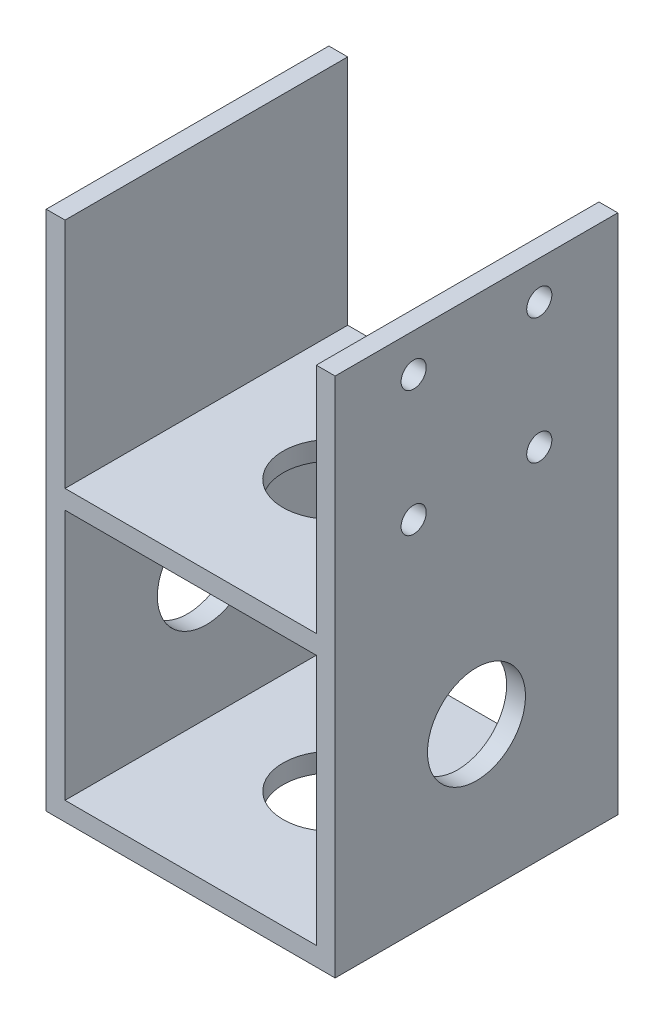
ISO-10303-21;
HEADER;
FILE_DESCRIPTION(('STEP AP214'),'2;1');
FILE_NAME('part.step','',(''),(''),'','','');
FILE_SCHEMA(('AUTOMOTIVE_DESIGN { 1 0 10303 214 1 1 1 1 }'));
ENDSEC;
DATA;
#1=APPLICATION_CONTEXT('core data for automotive mechanical design processes');
#2=APPLICATION_PROTOCOL_DEFINITION('international standard','automotive_design',2000,#1);
#3=PRODUCT_CONTEXT('',#1,'mechanical');
#4=PRODUCT('Part','Part','',(#3));
#5=PRODUCT_RELATED_PRODUCT_CATEGORY('part','',(#4));
#6=PRODUCT_DEFINITION_FORMATION('','',#4);
#7=PRODUCT_DEFINITION_CONTEXT('part definition',#1,'design');
#8=PRODUCT_DEFINITION('design','',#6,#7);
#9=PRODUCT_DEFINITION_SHAPE('','',#8);
#10=(LENGTH_UNIT() NAMED_UNIT(*) SI_UNIT(.MILLI.,.METRE.));
#11=(NAMED_UNIT(*) PLANE_ANGLE_UNIT() SI_UNIT($,.RADIAN.));
#12=(NAMED_UNIT(*) SI_UNIT($,.STERADIAN.) SOLID_ANGLE_UNIT());
#13=UNCERTAINTY_MEASURE_WITH_UNIT(LENGTH_MEASURE(1.E-05),#10,'distance_accuracy_value','');
#14=(GEOMETRIC_REPRESENTATION_CONTEXT(3) GLOBAL_UNCERTAINTY_ASSIGNED_CONTEXT((#13)) GLOBAL_UNIT_ASSIGNED_CONTEXT((#10,
#11,#12)) REPRESENTATION_CONTEXT('',''));
#15=CARTESIAN_POINT('',(0.,0.,0.));
#16=DIRECTION('',(0.,0.,1.));
#17=DIRECTION('',(1.,0.,0.));
#18=AXIS2_PLACEMENT_3D('',#15,#16,#17);
#19=CARTESIAN_POINT('',(20.,38.,-22.5));
#20=DIRECTION('',(1.,0.,0.));
#21=DIRECTION('',(0.,0.,-1.));
#22=AXIS2_PLACEMENT_3D('',#19,#20,#21);
#23=PLANE('',#22);
#24=CARTESIAN_POINT('',(20.,76.9556629991102,10.));
#25=DIRECTION('',(1.,0.,0.));
#26=DIRECTION('',(0.,0.,-1.));
#27=AXIS2_PLACEMENT_3D('',#24,#25,#26);
#28=CIRCLE('',#27,2.);
#29=CARTESIAN_POINT('',(20.,76.9556629991102,8.));
#30=VERTEX_POINT('',#29);
#31=EDGE_CURVE('E171',#30,#30,#28,.T.);
#32=ORIENTED_EDGE('',*,*,#31,.T.);
#33=EDGE_LOOP('',(#32));
#34=FACE_BOUND('',#33,.T.);
#35=CARTESIAN_POINT('',(20.,76.9556629991102,-10.));
#36=DIRECTION('',(1.,0.,0.));
#37=DIRECTION('',(0.,0.,-1.));
#38=AXIS2_PLACEMENT_3D('',#35,#36,#37);
#39=CIRCLE('',#38,2.);
#40=CARTESIAN_POINT('',(20.,76.9556629991102,-12.));
#41=VERTEX_POINT('',#40);
#42=EDGE_CURVE('E249',#41,#41,#39,.T.);
#43=ORIENTED_EDGE('',*,*,#42,.T.);
#44=EDGE_LOOP('',(#43));
#45=FACE_BOUND('',#44,.T.);
#46=CARTESIAN_POINT('',(20.,56.9556629991102,-10.));
#47=DIRECTION('',(1.,0.,0.));
#48=DIRECTION('',(0.,0.,-1.));
#49=AXIS2_PLACEMENT_3D('',#46,#47,#48);
#50=CIRCLE('',#49,2.);
#51=CARTESIAN_POINT('',(20.,56.9556629991102,-12.));
#52=VERTEX_POINT('',#51);
#53=EDGE_CURVE('E252',#52,#52,#50,.T.);
#54=ORIENTED_EDGE('',*,*,#53,.T.);
#55=EDGE_LOOP('',(#54));
#56=FACE_BOUND('',#55,.T.);
#57=CARTESIAN_POINT('',(20.,56.9556629991102,10.));
#58=DIRECTION('',(1.,0.,0.));
#59=DIRECTION('',(0.,0.,-1.));
#60=AXIS2_PLACEMENT_3D('',#57,#58,#59);
#61=CIRCLE('',#60,2.);
#62=CARTESIAN_POINT('',(20.,56.9556629991102,8.));
#63=VERTEX_POINT('',#62);
#64=EDGE_CURVE('E176',#63,#63,#61,.T.);
#65=ORIENTED_EDGE('',*,*,#64,.T.);
#66=EDGE_LOOP('',(#65));
#67=FACE_BOUND('',#66,.T.);
#68=DIRECTION('',(0.,0.,-1.));
#69=VECTOR('',#68,1.);
#70=CARTESIAN_POINT('',(20.,46.,-22.5));
#71=LINE('',#70,#69);
#72=CARTESIAN_POINT('',(20.,46.,22.5));
#73=VERTEX_POINT('',#72);
#74=CARTESIAN_POINT('',(20.,46.,-22.5));
#75=VERTEX_POINT('',#74);
#76=EDGE_CURVE('E156',#73,#75,#71,.T.);
#77=ORIENTED_EDGE('',*,*,#76,.F.);
#78=DIRECTION('',(0.,-1.,0.));
#79=VECTOR('',#78,1.);
#80=CARTESIAN_POINT('',(20.,38.,22.5));
#81=LINE('',#80,#79);
#82=CARTESIAN_POINT('',(20.,83.,22.5));
#83=VERTEX_POINT('',#82);
#84=EDGE_CURVE('E147',#83,#73,#81,.T.);
#85=ORIENTED_EDGE('',*,*,#84,.F.);
#86=DIRECTION('',(0.,0.,1.));
#87=VECTOR('',#86,1.);
#88=CARTESIAN_POINT('',(20.,83.,-22.5));
#89=LINE('',#88,#87);
#90=CARTESIAN_POINT('',(20.,83.,-22.5));
#91=VERTEX_POINT('',#90);
#92=EDGE_CURVE('E172',#91,#83,#89,.T.);
#93=ORIENTED_EDGE('',*,*,#92,.F.);
#94=DIRECTION('',(0.,-1.,0.));
#95=VECTOR('',#94,1.);
#96=CARTESIAN_POINT('',(20.,38.,-22.5));
#97=LINE('',#96,#95);
#98=EDGE_CURVE('E217',#91,#75,#97,.T.);
#99=ORIENTED_EDGE('',*,*,#98,.T.);
#100=EDGE_LOOP('',(#77,#85,#93,#99));
#101=FACE_BOUND('',#100,.T.);
#102=ADVANCED_FACE('F34',(#34,#45,#56,#67,#101),#23,.F.);
#103=CARTESIAN_POINT('',(-20.,38.,-22.5));
#104=DIRECTION('',(-1.,0.,0.));
#105=DIRECTION('',(0.,0.,1.));
#106=AXIS2_PLACEMENT_3D('',#103,#104,#105);
#107=PLANE('',#106);
#108=DIRECTION('',(0.,0.,1.));
#109=VECTOR('',#108,1.);
#110=CARTESIAN_POINT('',(-20.,46.,-22.5));
#111=LINE('',#110,#109);
#112=CARTESIAN_POINT('',(-20.,46.,-22.5));
#113=VERTEX_POINT('',#112);
#114=CARTESIAN_POINT('',(-20.,46.,22.5));
#115=VERTEX_POINT('',#114);
#116=EDGE_CURVE('E43',#113,#115,#111,.T.);
#117=ORIENTED_EDGE('',*,*,#116,.F.);
#118=DIRECTION('',(0.,-1.,0.));
#119=VECTOR('',#118,1.);
#120=CARTESIAN_POINT('',(-20.,38.,-22.5));
#121=LINE('',#120,#119);
#122=CARTESIAN_POINT('',(-20.,83.,-22.5));
#123=VERTEX_POINT('',#122);
#124=EDGE_CURVE('E212',#123,#113,#121,.T.);
#125=ORIENTED_EDGE('',*,*,#124,.F.);
#126=DIRECTION('',(0.,0.,-1.));
#127=VECTOR('',#126,1.);
#128=CARTESIAN_POINT('',(-20.,83.,-22.5));
#129=LINE('',#128,#127);
#130=CARTESIAN_POINT('',(-20.,83.,22.5));
#131=VERTEX_POINT('',#130);
#132=EDGE_CURVE('E125',#131,#123,#129,.T.);
#133=ORIENTED_EDGE('',*,*,#132,.F.);
#134=DIRECTION('',(0.,-1.,0.));
#135=VECTOR('',#134,1.);
#136=CARTESIAN_POINT('',(-20.,38.,22.5));
#137=LINE('',#136,#135);
#138=EDGE_CURVE('E120',#131,#115,#137,.T.);
#139=ORIENTED_EDGE('',*,*,#138,.T.);
#140=EDGE_LOOP('',(#117,#125,#133,#139));
#141=FACE_BOUND('',#140,.T.);
#142=ADVANCED_FACE('F122',(#141),#107,.F.);
#143=CARTESIAN_POINT('',(0.,3.,0.));
#144=DIRECTION('',(0.,1.,0.));
#145=DIRECTION('',(0.,0.,1.));
#146=AXIS2_PLACEMENT_3D('',#143,#144,#145);
#147=PLANE('',#146);
#148=CARTESIAN_POINT('',(0.,3.,0.));
#149=DIRECTION('',(0.,1.,0.));
#150=DIRECTION('',(0.,0.,1.));
#151=AXIS2_PLACEMENT_3D('',#148,#149,#150);
#152=CIRCLE('',#151,7.8);
#153=CARTESIAN_POINT('',(0.,3.,7.8));
#154=VERTEX_POINT('',#153);
#155=EDGE_CURVE('E204',#154,#154,#152,.T.);
#156=ORIENTED_EDGE('',*,*,#155,.F.);
#157=EDGE_LOOP('',(#156));
#158=FACE_BOUND('',#157,.T.);
#159=DIRECTION('',(-1.,0.,0.));
#160=VECTOR('',#159,1.);
#161=CARTESIAN_POINT('',(23.,3.,-22.5));
#162=LINE('',#161,#160);
#163=CARTESIAN_POINT('',(20.,3.,-22.5));
#164=VERTEX_POINT('',#163);
#165=CARTESIAN_POINT('',(-20.,3.,-22.5));
#166=VERTEX_POINT('',#165);
#167=EDGE_CURVE('E223',#164,#166,#162,.T.);
#168=ORIENTED_EDGE('',*,*,#167,.T.);
#169=DIRECTION('',(0.,0.,-1.));
#170=VECTOR('',#169,1.);
#171=CARTESIAN_POINT('',(-20.,3.,-22.5));
#172=LINE('',#171,#170);
#173=CARTESIAN_POINT('',(-20.,3.,22.5));
#174=VERTEX_POINT('',#173);
#175=EDGE_CURVE('E208',#174,#166,#172,.T.);
#176=ORIENTED_EDGE('',*,*,#175,.F.);
#177=DIRECTION('',(1.,0.,0.));
#178=VECTOR('',#177,1.);
#179=CARTESIAN_POINT('',(23.,3.,22.5));
#180=LINE('',#179,#178);
#181=CARTESIAN_POINT('',(20.,3.,22.5));
#182=VERTEX_POINT('',#181);
#183=EDGE_CURVE('E220',#174,#182,#180,.T.);
#184=ORIENTED_EDGE('',*,*,#183,.T.);
#185=DIRECTION('',(0.,0.,1.));
#186=VECTOR('',#185,1.);
#187=CARTESIAN_POINT('',(20.,3.,-22.5));
#188=LINE('',#187,#186);
#189=EDGE_CURVE('E130',#164,#182,#188,.T.);
#190=ORIENTED_EDGE('',*,*,#189,.F.);
#191=EDGE_LOOP('',(#168,#176,#184,#190));
#192=FACE_BOUND('',#191,.T.);
#193=ADVANCED_FACE('F283',(#158,#192),#147,.T.);
#194=CARTESIAN_POINT('',(-23.,3.,22.5));
#195=DIRECTION('',(1.,0.,0.));
#196=DIRECTION('',(0.,0.,-1.));
#197=AXIS2_PLACEMENT_3D('',#194,#195,#196);
#198=PLANE('',#197);
#199=CARTESIAN_POINT('',(-23.,23.75,0.));
#200=DIRECTION('',(-1.,0.,0.));
#201=DIRECTION('',(0.,0.,1.));
#202=AXIS2_PLACEMENT_3D('',#199,#200,#201);
#203=CIRCLE('',#202,7.8);
#204=CARTESIAN_POINT('',(-23.,23.75,7.80000000000001));
#205=VERTEX_POINT('',#204);
#206=EDGE_CURVE('E194',#205,#205,#203,.T.);
#207=ORIENTED_EDGE('',*,*,#206,.F.);
#208=EDGE_LOOP('',(#207));
#209=FACE_BOUND('',#208,.T.);
#210=DIRECTION('',(0.,0.,1.));
#211=VECTOR('',#210,1.);
#212=CARTESIAN_POINT('',(-23.,0.,22.5));
#213=LINE('',#212,#211);
#214=CARTESIAN_POINT('',(-23.,0.,-22.5));
#215=VERTEX_POINT('',#214);
#216=CARTESIAN_POINT('',(-23.,0.,22.5));
#217=VERTEX_POINT('',#216);
#218=EDGE_CURVE('E219',#215,#217,#213,.T.);
#219=ORIENTED_EDGE('',*,*,#218,.T.);
#220=DIRECTION('',(0.,-1.,0.));
#221=VECTOR('',#220,1.);
#222=CARTESIAN_POINT('',(-23.,3.,22.5));
#223=LINE('',#222,#221);
#224=CARTESIAN_POINT('',(-23.,83.,22.5));
#225=VERTEX_POINT('',#224);
#226=EDGE_CURVE('E141',#225,#217,#223,.T.);
#227=ORIENTED_EDGE('',*,*,#226,.F.);
#228=DIRECTION('',(0.,0.,1.));
#229=VECTOR('',#228,1.);
#230=CARTESIAN_POINT('',(-23.,83.,-22.5));
#231=LINE('',#230,#229);
#232=CARTESIAN_POINT('',(-23.,83.,-22.5));
#233=VERTEX_POINT('',#232);
#234=EDGE_CURVE('E185',#233,#225,#231,.T.);
#235=ORIENTED_EDGE('',*,*,#234,.F.);
#236=DIRECTION('',(0.,-1.,0.));
#237=VECTOR('',#236,1.);
#238=CARTESIAN_POINT('',(-23.,3.,-22.5));
#239=LINE('',#238,#237);
#240=EDGE_CURVE('E227',#233,#215,#239,.T.);
#241=ORIENTED_EDGE('',*,*,#240,.T.);
#242=EDGE_LOOP('',(#219,#227,#235,#241));
#243=FACE_BOUND('',#242,.T.);
#244=ADVANCED_FACE('F36',(#209,#243),#198,.F.);
#245=CARTESIAN_POINT('',(23.,3.,22.5));
#246=DIRECTION('',(0.,0.,-1.));
#247=DIRECTION('',(-1.,0.,0.));
#248=AXIS2_PLACEMENT_3D('',#245,#246,#247);
#249=PLANE('',#248);
#250=DIRECTION('',(1.,0.,0.));
#251=VECTOR('',#250,1.);
#252=CARTESIAN_POINT('',(23.,43.,22.5));
#253=LINE('',#252,#251);
#254=CARTESIAN_POINT('',(-20.,43.,22.5));
#255=VERTEX_POINT('',#254);
#256=CARTESIAN_POINT('',(20.,43.,22.5));
#257=VERTEX_POINT('',#256);
#258=EDGE_CURVE('E151',#255,#257,#253,.T.);
#259=ORIENTED_EDGE('',*,*,#258,.T.);
#260=EDGE_CURVE('E55',#257,#182,#81,.T.);
#261=ORIENTED_EDGE('',*,*,#260,.T.);
#262=ORIENTED_EDGE('',*,*,#183,.F.);
#263=EDGE_CURVE('E131',#255,#174,#137,.T.);
#264=ORIENTED_EDGE('',*,*,#263,.F.);
#265=EDGE_LOOP('',(#259,#261,#262,#264));
#266=FACE_BOUND('',#265,.T.);
#267=DIRECTION('',(1.,0.,0.));
#268=VECTOR('',#267,1.);
#269=CARTESIAN_POINT('',(23.,0.,22.5));
#270=LINE('',#269,#268);
#271=CARTESIAN_POINT('',(23.,0.,22.5));
#272=VERTEX_POINT('',#271);
#273=EDGE_CURVE('E230',#217,#272,#270,.T.);
#274=ORIENTED_EDGE('',*,*,#273,.T.);
#275=DIRECTION('',(0.,-1.,0.));
#276=VECTOR('',#275,1.);
#277=CARTESIAN_POINT('',(23.,3.,22.5));
#278=LINE('',#277,#276);
#279=CARTESIAN_POINT('',(23.,83.,22.5));
#280=VERTEX_POINT('',#279);
#281=EDGE_CURVE('E240',#280,#272,#278,.T.);
#282=ORIENTED_EDGE('',*,*,#281,.F.);
#283=DIRECTION('',(1.,0.,0.));
#284=VECTOR('',#283,1.);
#285=CARTESIAN_POINT('',(20.,83.,22.5));
#286=LINE('',#285,#284);
#287=EDGE_CURVE('E175',#83,#280,#286,.T.);
#288=ORIENTED_EDGE('',*,*,#287,.F.);
#289=ORIENTED_EDGE('',*,*,#84,.T.);
#290=DIRECTION('',(1.,0.,0.));
#291=VECTOR('',#290,1.);
#292=CARTESIAN_POINT('',(23.,46.,22.5));
#293=LINE('',#292,#291);
#294=EDGE_CURVE('E138',#115,#73,#293,.T.);
#295=ORIENTED_EDGE('',*,*,#294,.F.);
#296=ORIENTED_EDGE('',*,*,#138,.F.);
#297=DIRECTION('',(1.,0.,0.));
#298=VECTOR('',#297,1.);
#299=CARTESIAN_POINT('',(-23.,83.,22.5));
#300=LINE('',#299,#298);
#301=EDGE_CURVE('E188',#225,#131,#300,.T.);
#302=ORIENTED_EDGE('',*,*,#301,.F.);
#303=ORIENTED_EDGE('',*,*,#226,.T.);
#304=EDGE_LOOP('',(#274,#282,#288,#289,#295,#296,#302,#303));
#305=FACE_BOUND('',#304,.T.);
#306=ADVANCED_FACE('F145',(#266,#305),#249,.F.);
#307=CARTESIAN_POINT('',(23.,3.,22.5));
#308=DIRECTION('',(-1.,0.,0.));
#309=DIRECTION('',(0.,0.,1.));
#310=AXIS2_PLACEMENT_3D('',#307,#308,#309);
#311=PLANE('',#310);
#312=CARTESIAN_POINT('',(23.,23.75,0.));
#313=DIRECTION('',(-1.,0.,0.));
#314=DIRECTION('',(0.,0.,1.));
#315=AXIS2_PLACEMENT_3D('',#312,#313,#314);
#316=CIRCLE('',#315,7.8);
#317=CARTESIAN_POINT('',(23.,23.75,7.80000000000001));
#318=VERTEX_POINT('',#317);
#319=EDGE_CURVE('E195',#318,#318,#316,.T.);
#320=ORIENTED_EDGE('',*,*,#319,.T.);
#321=EDGE_LOOP('',(#320));
#322=FACE_BOUND('',#321,.T.);
#323=DIRECTION('',(0.,0.,-1.));
#324=VECTOR('',#323,1.);
#325=CARTESIAN_POINT('',(23.,0.,22.5));
#326=LINE('',#325,#324);
#327=CARTESIAN_POINT('',(23.,0.,-22.5));
#328=VERTEX_POINT('',#327);
#329=EDGE_CURVE('E232',#272,#328,#326,.T.);
#330=ORIENTED_EDGE('',*,*,#329,.T.);
#331=DIRECTION('',(0.,-1.,0.));
#332=VECTOR('',#331,1.);
#333=CARTESIAN_POINT('',(23.,3.,-22.5));
#334=LINE('',#333,#332);
#335=CARTESIAN_POINT('',(23.,83.,-22.5));
#336=VERTEX_POINT('',#335);
#337=EDGE_CURVE('E238',#336,#328,#334,.T.);
#338=ORIENTED_EDGE('',*,*,#337,.F.);
#339=DIRECTION('',(0.,0.,-1.));
#340=VECTOR('',#339,1.);
#341=CARTESIAN_POINT('',(23.,83.,-22.5));
#342=LINE('',#341,#340);
#343=EDGE_CURVE('E179',#280,#336,#342,.T.);
#344=ORIENTED_EDGE('',*,*,#343,.F.);
#345=ORIENTED_EDGE('',*,*,#281,.T.);
#346=EDGE_LOOP('',(#330,#338,#344,#345));
#347=FACE_BOUND('',#346,.T.);
#348=CARTESIAN_POINT('',(23.,76.9556629991102,10.));
#349=DIRECTION('',(1.,0.,0.));
#350=DIRECTION('',(0.,0.,-1.));
#351=AXIS2_PLACEMENT_3D('',#348,#349,#350);
#352=CIRCLE('',#351,2.);
#353=CARTESIAN_POINT('',(23.,76.9556629991102,8.));
#354=VERTEX_POINT('',#353);
#355=EDGE_CURVE('E163',#354,#354,#352,.T.);
#356=ORIENTED_EDGE('',*,*,#355,.F.);
#357=EDGE_LOOP('',(#356));
#358=FACE_BOUND('',#357,.T.);
#359=CARTESIAN_POINT('',(23.,76.9556629991102,-10.));
#360=DIRECTION('',(1.,0.,0.));
#361=DIRECTION('',(0.,0.,1.));
#362=AXIS2_PLACEMENT_3D('',#359,#360,#361);
#363=CIRCLE('',#362,2.);
#364=CARTESIAN_POINT('',(23.,76.9556629991102,-8.));
#365=VERTEX_POINT('',#364);
#366=EDGE_CURVE('E160',#365,#365,#363,.T.);
#367=ORIENTED_EDGE('',*,*,#366,.F.);
#368=EDGE_LOOP('',(#367));
#369=FACE_BOUND('',#368,.T.);
#370=CARTESIAN_POINT('',(23.,56.9556629991102,-10.));
#371=DIRECTION('',(1.,0.,0.));
#372=DIRECTION('',(0.,0.,-1.));
#373=AXIS2_PLACEMENT_3D('',#370,#371,#372);
#374=CIRCLE('',#373,2.);
#375=CARTESIAN_POINT('',(23.,56.9556629991102,-12.));
#376=VERTEX_POINT('',#375);
#377=EDGE_CURVE('E164',#376,#376,#374,.T.);
#378=ORIENTED_EDGE('',*,*,#377,.F.);
#379=EDGE_LOOP('',(#378));
#380=FACE_BOUND('',#379,.T.);
#381=CARTESIAN_POINT('',(23.,56.9556629991102,10.));
#382=DIRECTION('',(1.,0.,0.));
#383=DIRECTION('',(0.,0.,1.));
#384=AXIS2_PLACEMENT_3D('',#381,#382,#383);
#385=CIRCLE('',#384,2.);
#386=CARTESIAN_POINT('',(23.,56.9556629991102,12.));
#387=VERTEX_POINT('',#386);
#388=EDGE_CURVE('E159',#387,#387,#385,.T.);
#389=ORIENTED_EDGE('',*,*,#388,.F.);
#390=EDGE_LOOP('',(#389));
#391=FACE_BOUND('',#390,.T.);
#392=ADVANCED_FACE('F338',(#322,#347,#358,#369,#380,#391),#311,.F.);
#393=CARTESIAN_POINT('',(23.,3.,-22.5));
#394=DIRECTION('',(0.,0.,1.));
#395=DIRECTION('',(1.,0.,0.));
#396=AXIS2_PLACEMENT_3D('',#393,#394,#395);
#397=PLANE('',#396);
#398=DIRECTION('',(-1.,0.,0.));
#399=VECTOR('',#398,1.);
#400=CARTESIAN_POINT('',(23.,43.,-22.5));
#401=LINE('',#400,#399);
#402=CARTESIAN_POINT('',(20.,43.,-22.5));
#403=VERTEX_POINT('',#402);
#404=CARTESIAN_POINT('',(-20.,43.,-22.5));
#405=VERTEX_POINT('',#404);
#406=EDGE_CURVE('E148',#403,#405,#401,.T.);
#407=ORIENTED_EDGE('',*,*,#406,.T.);
#408=EDGE_CURVE('E211',#405,#166,#121,.T.);
#409=ORIENTED_EDGE('',*,*,#408,.T.);
#410=ORIENTED_EDGE('',*,*,#167,.F.);
#411=EDGE_CURVE('E216',#403,#164,#97,.T.);
#412=ORIENTED_EDGE('',*,*,#411,.F.);
#413=EDGE_LOOP('',(#407,#409,#410,#412));
#414=FACE_BOUND('',#413,.T.);
#415=DIRECTION('',(-1.,0.,0.));
#416=VECTOR('',#415,1.);
#417=CARTESIAN_POINT('',(23.,0.,-22.5));
#418=LINE('',#417,#416);
#419=EDGE_CURVE('E224',#328,#215,#418,.T.);
#420=ORIENTED_EDGE('',*,*,#419,.T.);
#421=ORIENTED_EDGE('',*,*,#240,.F.);
#422=DIRECTION('',(-1.,0.,0.));
#423=VECTOR('',#422,1.);
#424=CARTESIAN_POINT('',(-23.,83.,-22.5));
#425=LINE('',#424,#423);
#426=EDGE_CURVE('E191',#123,#233,#425,.T.);
#427=ORIENTED_EDGE('',*,*,#426,.F.);
#428=ORIENTED_EDGE('',*,*,#124,.T.);
#429=DIRECTION('',(-1.,0.,0.));
#430=VECTOR('',#429,1.);
#431=CARTESIAN_POINT('',(23.,46.,-22.5));
#432=LINE('',#431,#430);
#433=EDGE_CURVE('E140',#75,#113,#432,.T.);
#434=ORIENTED_EDGE('',*,*,#433,.F.);
#435=ORIENTED_EDGE('',*,*,#98,.F.);
#436=DIRECTION('',(-1.,0.,0.));
#437=VECTOR('',#436,1.);
#438=CARTESIAN_POINT('',(20.,83.,-22.5));
#439=LINE('',#438,#437);
#440=EDGE_CURVE('E182',#336,#91,#439,.T.);
#441=ORIENTED_EDGE('',*,*,#440,.F.);
#442=ORIENTED_EDGE('',*,*,#337,.T.);
#443=EDGE_LOOP('',(#420,#421,#427,#428,#434,#435,#441,#442));
#444=FACE_BOUND('',#443,.T.);
#445=ADVANCED_FACE('F297',(#414,#444),#397,.F.);
#446=CARTESIAN_POINT('',(0.,0.,0.));
#447=DIRECTION('',(0.,1.,0.));
#448=DIRECTION('',(0.,0.,1.));
#449=AXIS2_PLACEMENT_3D('',#446,#447,#448);
#450=PLANE('',#449);
#451=CARTESIAN_POINT('',(0.,0.,0.));
#452=DIRECTION('',(0.,1.,0.));
#453=DIRECTION('',(0.,0.,1.));
#454=AXIS2_PLACEMENT_3D('',#451,#452,#453);
#455=CIRCLE('',#454,7.8);
#456=CARTESIAN_POINT('',(0.,0.,7.8));
#457=VERTEX_POINT('',#456);
#458=EDGE_CURVE('E207',#457,#457,#455,.T.);
#459=ORIENTED_EDGE('',*,*,#458,.T.);
#460=EDGE_LOOP('',(#459));
#461=FACE_BOUND('',#460,.T.);
#462=ORIENTED_EDGE('',*,*,#218,.F.);
#463=ORIENTED_EDGE('',*,*,#419,.F.);
#464=ORIENTED_EDGE('',*,*,#329,.F.);
#465=ORIENTED_EDGE('',*,*,#273,.F.);
#466=EDGE_LOOP('',(#462,#463,#464,#465));
#467=FACE_BOUND('',#466,.T.);
#468=ADVANCED_FACE('F289',(#461,#467),#450,.F.);
#469=CARTESIAN_POINT('',(20.,23.75,0.));
#470=DIRECTION('',(1.,0.,0.));
#471=DIRECTION('',(0.,0.,-1.));
#472=AXIS2_PLACEMENT_3D('',#469,#470,#471);
#473=CIRCLE('',#472,7.8);
#474=CARTESIAN_POINT('',(20.,23.75,-7.8));
#475=VERTEX_POINT('',#474);
#476=EDGE_CURVE('E201',#475,#475,#473,.T.);
#477=ORIENTED_EDGE('',*,*,#476,.T.);
#478=EDGE_LOOP('',(#477));
#479=FACE_BOUND('',#478,.T.);
#480=ORIENTED_EDGE('',*,*,#260,.F.);
#481=DIRECTION('',(0.,0.,-1.));
#482=VECTOR('',#481,1.);
#483=CARTESIAN_POINT('',(20.,43.,-22.5));
#484=LINE('',#483,#482);
#485=EDGE_CURVE('E50',#257,#403,#484,.T.);
#486=ORIENTED_EDGE('',*,*,#485,.T.);
#487=ORIENTED_EDGE('',*,*,#411,.T.);
#488=ORIENTED_EDGE('',*,*,#189,.T.);
#489=EDGE_LOOP('',(#480,#486,#487,#488));
#490=FACE_BOUND('',#489,.T.);
#491=ADVANCED_FACE('F279',(#479,#490),#23,.F.);
#492=CARTESIAN_POINT('',(-20.,23.75,0.));
#493=DIRECTION('',(-1.,0.,0.));
#494=DIRECTION('',(0.,0.,1.));
#495=AXIS2_PLACEMENT_3D('',#492,#493,#494);
#496=CIRCLE('',#495,7.8);
#497=CARTESIAN_POINT('',(-20.,23.75,7.80000000000001));
#498=VERTEX_POINT('',#497);
#499=EDGE_CURVE('E198',#498,#498,#496,.T.);
#500=ORIENTED_EDGE('',*,*,#499,.T.);
#501=EDGE_LOOP('',(#500));
#502=FACE_BOUND('',#501,.T.);
#503=ORIENTED_EDGE('',*,*,#408,.F.);
#504=DIRECTION('',(0.,0.,1.));
#505=VECTOR('',#504,1.);
#506=CARTESIAN_POINT('',(-20.,43.,-22.5));
#507=LINE('',#506,#505);
#508=EDGE_CURVE('E11',#405,#255,#507,.T.);
#509=ORIENTED_EDGE('',*,*,#508,.T.);
#510=ORIENTED_EDGE('',*,*,#263,.T.);
#511=ORIENTED_EDGE('',*,*,#175,.T.);
#512=EDGE_LOOP('',(#503,#509,#510,#511));
#513=FACE_BOUND('',#512,.T.);
#514=ADVANCED_FACE('F285',(#502,#513),#107,.F.);
#515=CARTESIAN_POINT('',(0.,-7.,0.));
#516=DIRECTION('',(0.,1.,0.));
#517=DIRECTION('',(0.,0.,1.));
#518=AXIS2_PLACEMENT_3D('',#515,#516,#517);
#519=CYLINDRICAL_SURFACE('',#518,7.8);
#520=ORIENTED_EDGE('',*,*,#155,.T.);
#521=EDGE_LOOP('',(#520));
#522=FACE_BOUND('',#521,.T.);
#523=ORIENTED_EDGE('',*,*,#458,.F.);
#524=EDGE_LOOP('',(#523));
#525=FACE_BOUND('',#524,.T.);
#526=ADVANCED_FACE('F295',(#522,#525),#519,.F.);
#527=CARTESIAN_POINT('',(23.,23.75,0.));
#528=DIRECTION('',(-1.,0.,0.));
#529=DIRECTION('',(0.,0.,1.));
#530=AXIS2_PLACEMENT_3D('',#527,#528,#529);
#531=CYLINDRICAL_SURFACE('',#530,7.8);
#532=ORIENTED_EDGE('',*,*,#206,.T.);
#533=EDGE_LOOP('',(#532));
#534=FACE_BOUND('',#533,.T.);
#535=ORIENTED_EDGE('',*,*,#499,.F.);
#536=EDGE_LOOP('',(#535));
#537=FACE_BOUND('',#536,.T.);
#538=ADVANCED_FACE('F305',(#534,#537),#531,.F.);
#539=ORIENTED_EDGE('',*,*,#319,.F.);
#540=EDGE_LOOP('',(#539));
#541=FACE_BOUND('',#540,.T.);
#542=ORIENTED_EDGE('',*,*,#476,.F.);
#543=EDGE_LOOP('',(#542));
#544=FACE_BOUND('',#543,.T.);
#545=ADVANCED_FACE('F302',(#541,#544),#531,.F.);
#546=CARTESIAN_POINT('',(0.,83.,0.));
#547=DIRECTION('',(0.,1.,0.));
#548=DIRECTION('',(0.,0.,1.));
#549=AXIS2_PLACEMENT_3D('',#546,#547,#548);
#550=PLANE('',#549);
#551=ORIENTED_EDGE('',*,*,#234,.T.);
#552=ORIENTED_EDGE('',*,*,#301,.T.);
#553=ORIENTED_EDGE('',*,*,#132,.T.);
#554=ORIENTED_EDGE('',*,*,#426,.T.);
#555=EDGE_LOOP('',(#551,#552,#553,#554));
#556=FACE_BOUND('',#555,.T.);
#557=ADVANCED_FACE('F304',(#556),#550,.T.);
#558=CARTESIAN_POINT('',(0.,83.,0.));
#559=DIRECTION('',(0.,1.,0.));
#560=DIRECTION('',(0.,0.,1.));
#561=AXIS2_PLACEMENT_3D('',#558,#559,#560);
#562=PLANE('',#561);
#563=ORIENTED_EDGE('',*,*,#92,.T.);
#564=ORIENTED_EDGE('',*,*,#287,.T.);
#565=ORIENTED_EDGE('',*,*,#343,.T.);
#566=ORIENTED_EDGE('',*,*,#440,.T.);
#567=EDGE_LOOP('',(#563,#564,#565,#566));
#568=FACE_BOUND('',#567,.T.);
#569=ADVANCED_FACE('F312',(#568),#562,.T.);
#570=CARTESIAN_POINT('',(13.,76.9556629991102,10.));
#571=DIRECTION('',(1.,0.,0.));
#572=DIRECTION('',(0.,0.,-1.));
#573=AXIS2_PLACEMENT_3D('',#570,#571,#572);
#574=CYLINDRICAL_SURFACE('',#573,2.);
#575=ORIENTED_EDGE('',*,*,#355,.T.);
#576=EDGE_LOOP('',(#575));
#577=FACE_BOUND('',#576,.T.);
#578=ORIENTED_EDGE('',*,*,#31,.F.);
#579=EDGE_LOOP('',(#578));
#580=FACE_BOUND('',#579,.T.);
#581=ADVANCED_FACE('F343',(#577,#580),#574,.F.);
#582=CARTESIAN_POINT('',(13.,76.9556629991102,-10.));
#583=DIRECTION('',(1.,0.,0.));
#584=DIRECTION('',(0.,0.,-1.));
#585=AXIS2_PLACEMENT_3D('',#582,#583,#584);
#586=CYLINDRICAL_SURFACE('',#585,2.);
#587=ORIENTED_EDGE('',*,*,#366,.T.);
#588=EDGE_LOOP('',(#587));
#589=FACE_BOUND('',#588,.T.);
#590=ORIENTED_EDGE('',*,*,#42,.F.);
#591=EDGE_LOOP('',(#590));
#592=FACE_BOUND('',#591,.T.);
#593=ADVANCED_FACE('F272',(#589,#592),#586,.F.);
#594=CARTESIAN_POINT('',(13.,56.9556629991102,-10.));
#595=DIRECTION('',(1.,0.,0.));
#596=DIRECTION('',(0.,0.,-1.));
#597=AXIS2_PLACEMENT_3D('',#594,#595,#596);
#598=CYLINDRICAL_SURFACE('',#597,2.);
#599=ORIENTED_EDGE('',*,*,#377,.T.);
#600=EDGE_LOOP('',(#599));
#601=FACE_BOUND('',#600,.T.);
#602=ORIENTED_EDGE('',*,*,#53,.F.);
#603=EDGE_LOOP('',(#602));
#604=FACE_BOUND('',#603,.T.);
#605=ADVANCED_FACE('F263',(#601,#604),#598,.F.);
#606=CARTESIAN_POINT('',(13.,56.9556629991102,10.));
#607=DIRECTION('',(1.,0.,0.));
#608=DIRECTION('',(0.,0.,-1.));
#609=AXIS2_PLACEMENT_3D('',#606,#607,#608);
#610=CYLINDRICAL_SURFACE('',#609,2.);
#611=ORIENTED_EDGE('',*,*,#388,.T.);
#612=EDGE_LOOP('',(#611));
#613=FACE_BOUND('',#612,.T.);
#614=ORIENTED_EDGE('',*,*,#64,.F.);
#615=EDGE_LOOP('',(#614));
#616=FACE_BOUND('',#615,.T.);
#617=ADVANCED_FACE('F260',(#613,#616),#610,.F.);
#618=CARTESIAN_POINT('',(0.,43.,0.));
#619=DIRECTION('',(0.,-1.,0.));
#620=DIRECTION('',(0.,0.,1.));
#621=AXIS2_PLACEMENT_3D('',#618,#619,#620);
#622=PLANE('',#621);
#623=CARTESIAN_POINT('',(0.,43.,0.));
#624=DIRECTION('',(0.,1.,0.));
#625=DIRECTION('',(0.,0.,1.));
#626=AXIS2_PLACEMENT_3D('',#623,#624,#625);
#627=CIRCLE('',#626,7.8);
#628=CARTESIAN_POINT('',(0.,43.,7.8));
#629=VERTEX_POINT('',#628);
#630=EDGE_CURVE('E396',#629,#629,#627,.T.);
#631=ORIENTED_EDGE('',*,*,#630,.T.);
#632=EDGE_LOOP('',(#631));
#633=FACE_BOUND('',#632,.T.);
#634=ORIENTED_EDGE('',*,*,#485,.F.);
#635=ORIENTED_EDGE('',*,*,#258,.F.);
#636=ORIENTED_EDGE('',*,*,#508,.F.);
#637=ORIENTED_EDGE('',*,*,#406,.F.);
#638=EDGE_LOOP('',(#634,#635,#636,#637));
#639=FACE_BOUND('',#638,.T.);
#640=ADVANCED_FACE('F262',(#633,#639),#622,.T.);
#641=CARTESIAN_POINT('',(0.,46.,0.));
#642=DIRECTION('',(0.,-1.,0.));
#643=DIRECTION('',(0.,0.,1.));
#644=AXIS2_PLACEMENT_3D('',#641,#642,#643);
#645=PLANE('',#644);
#646=CARTESIAN_POINT('',(0.,46.,0.));
#647=DIRECTION('',(0.,-1.,0.));
#648=DIRECTION('',(0.,0.,-1.));
#649=AXIS2_PLACEMENT_3D('',#646,#647,#648);
#650=CIRCLE('',#649,7.8);
#651=CARTESIAN_POINT('',(0.,46.,-7.8));
#652=VERTEX_POINT('',#651);
#653=EDGE_CURVE('E38',#652,#652,#650,.F.);
#654=ORIENTED_EDGE('',*,*,#653,.F.);
#655=EDGE_LOOP('',(#654));
#656=FACE_BOUND('',#655,.T.);
#657=ORIENTED_EDGE('',*,*,#294,.T.);
#658=ORIENTED_EDGE('',*,*,#76,.T.);
#659=ORIENTED_EDGE('',*,*,#433,.T.);
#660=ORIENTED_EDGE('',*,*,#116,.T.);
#661=EDGE_LOOP('',(#657,#658,#659,#660));
#662=FACE_BOUND('',#661,.T.);
#663=ADVANCED_FACE('F136',(#656,#662),#645,.F.);
#664=CARTESIAN_POINT('',(0.,53.,0.));
#665=DIRECTION('',(0.,-1.,0.));
#666=DIRECTION('',(0.,0.,-1.));
#667=AXIS2_PLACEMENT_3D('',#664,#665,#666);
#668=CYLINDRICAL_SURFACE('',#667,7.8);
#669=ORIENTED_EDGE('',*,*,#630,.F.);
#670=EDGE_LOOP('',(#669));
#671=FACE_BOUND('',#670,.T.);
#672=ORIENTED_EDGE('',*,*,#653,.T.);
#673=EDGE_LOOP('',(#672));
#674=FACE_BOUND('',#673,.T.);
#675=ADVANCED_FACE('F402',(#671,#674),#668,.F.);
#676=CLOSED_SHELL('',(#102,#142,#193,#244,#306,#392,#445,#468,#491,#514,#526,#538,#545,#557,
#569,#581,#593,#605,#617,#640,#663,#675));
#677=MANIFOLD_SOLID_BREP('B2',#676);
#678=ADVANCED_BREP_SHAPE_REPRESENTATION('',(#18,#677),#14);
#679=SHAPE_DEFINITION_REPRESENTATION(#9,#678);
ENDSEC;
END-ISO-10303-21;
